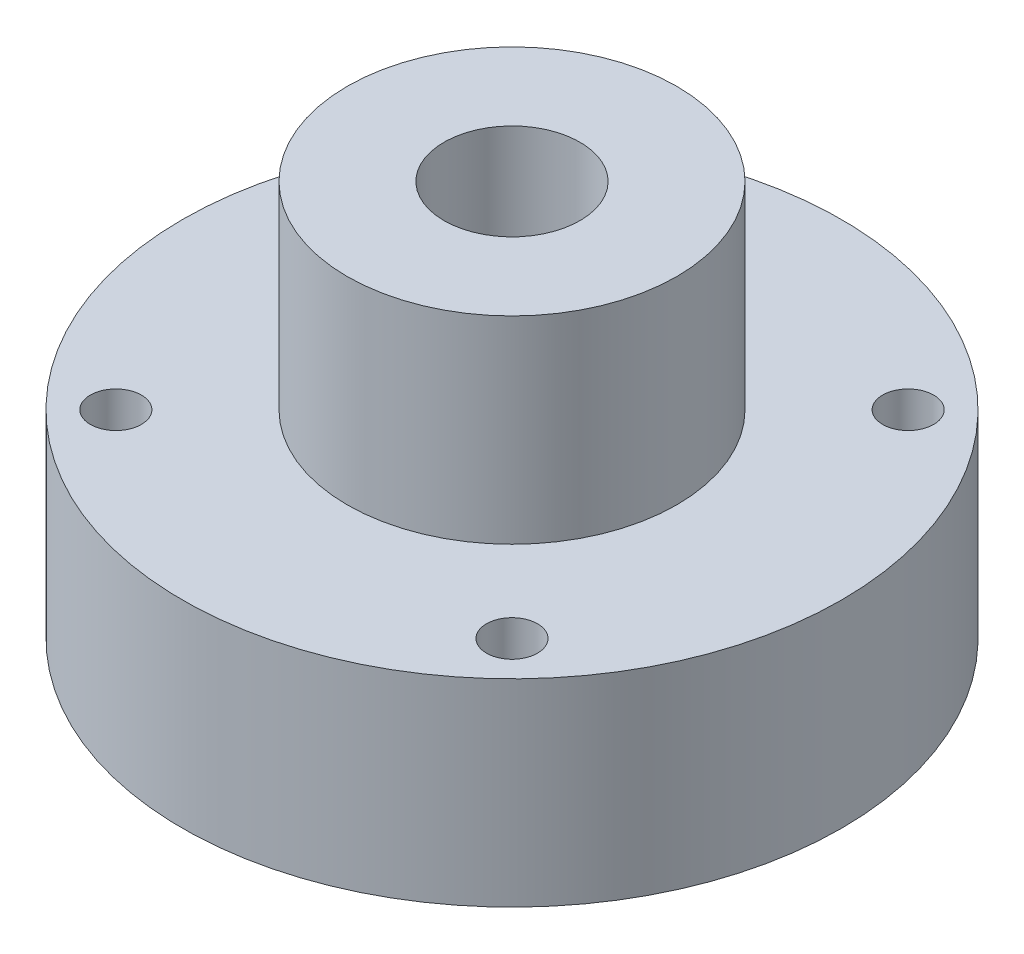
ISO-10303-21;
HEADER;
FILE_DESCRIPTION(('STEP AP214'),'2;1');
FILE_NAME('part.step','',(''),(''),'','','');
FILE_SCHEMA(('AUTOMOTIVE_DESIGN { 1 0 10303 214 1 1 1 1 }'));
ENDSEC;
DATA;
#1=APPLICATION_CONTEXT('core data for automotive mechanical design processes');
#2=APPLICATION_PROTOCOL_DEFINITION('international standard','automotive_design',2000,#1);
#3=PRODUCT_CONTEXT('',#1,'mechanical');
#4=PRODUCT('Part','Part','',(#3));
#5=PRODUCT_RELATED_PRODUCT_CATEGORY('part','',(#4));
#6=PRODUCT_DEFINITION_FORMATION('','',#4);
#7=PRODUCT_DEFINITION_CONTEXT('part definition',#1,'design');
#8=PRODUCT_DEFINITION('design','',#6,#7);
#9=PRODUCT_DEFINITION_SHAPE('','',#8);
#10=(LENGTH_UNIT() NAMED_UNIT(*) SI_UNIT(.MILLI.,.METRE.));
#11=(NAMED_UNIT(*) PLANE_ANGLE_UNIT() SI_UNIT($,.RADIAN.));
#12=(NAMED_UNIT(*) SI_UNIT($,.STERADIAN.) SOLID_ANGLE_UNIT());
#13=UNCERTAINTY_MEASURE_WITH_UNIT(LENGTH_MEASURE(1.E-05),#10,'distance_accuracy_value','');
#14=(GEOMETRIC_REPRESENTATION_CONTEXT(3) GLOBAL_UNCERTAINTY_ASSIGNED_CONTEXT((#13)) GLOBAL_UNIT_ASSIGNED_CONTEXT((#10,
#11,#12)) REPRESENTATION_CONTEXT('',''));
#15=CARTESIAN_POINT('',(0.,0.,0.));
#16=DIRECTION('',(0.,0.,1.));
#17=DIRECTION('',(1.,0.,0.));
#18=AXIS2_PLACEMENT_3D('',#15,#16,#17);
#19=CARTESIAN_POINT('',(0.,-38.1000000000001,0.));
#20=DIRECTION('',(0.,-1.,0.));
#21=DIRECTION('',(1.,0.,0.));
#22=AXIS2_PLACEMENT_3D('',#19,#20,#21);
#23=PLANE('',#22);
#24=CARTESIAN_POINT('',(-1.81426335150066E-13,-38.1000000000001,0.));
#25=DIRECTION('',(0.,1.,0.));
#26=DIRECTION('',(-1.,0.,0.));
#27=AXIS2_PLACEMENT_3D('',#24,#25,#26);
#28=CIRCLE('',#27,12.6999999999998);
#29=CARTESIAN_POINT('',(-12.7,-38.1,0.));
#30=VERTEX_POINT('',#29);
#31=EDGE_CURVE('E10',#30,#30,#28,.T.);
#32=ORIENTED_EDGE('',*,*,#31,.T.);
#33=EDGE_LOOP('',(#32));
#34=FACE_BOUND('',#33,.T.);
#35=CARTESIAN_POINT('',(-1.81426335150066E-13,-38.1000000000001,0.));
#36=DIRECTION('',(0.,1.,0.));
#37=DIRECTION('',(-1.,0.,0.));
#38=AXIS2_PLACEMENT_3D('',#35,#36,#37);
#39=CIRCLE('',#38,19.0372999999998);
#40=CARTESIAN_POINT('',(-19.0373,-38.1,0.));
#41=VERTEX_POINT('',#40);
#42=EDGE_CURVE('E67',#41,#41,#39,.T.);
#43=ORIENTED_EDGE('',*,*,#42,.F.);
#44=EDGE_LOOP('',(#43));
#45=FACE_BOUND('',#44,.T.);
#46=ADVANCED_FACE('F36',(#34,#45),#23,.T.);
#47=CARTESIAN_POINT('',(-1.81426335150066E-13,-38.1000000000001,0.));
#48=DIRECTION('',(0.,-1.,0.));
#49=DIRECTION('',(1.,0.,0.));
#50=AXIS2_PLACEMENT_3D('',#47,#48,#49);
#51=CONICAL_SURFACE('',#50,12.6999999999998,0.463647609000801);
#52=CARTESIAN_POINT('',(-1.22841352512309E-13,-25.7970020000003,0.));
#53=DIRECTION('',(0.,-1.,0.));
#54=DIRECTION('',(1.,0.,0.));
#55=AXIS2_PLACEMENT_3D('',#52,#53,#54);
#56=CIRCLE('',#55,6.54850099999999);
#57=CARTESIAN_POINT('',(6.54850099999987,-25.7970020000003,0.));
#58=VERTEX_POINT('',#57);
#59=EDGE_CURVE('E91',#58,#58,#56,.T.);
#60=ORIENTED_EDGE('',*,*,#59,.F.);
#61=EDGE_LOOP('',(#60));
#62=FACE_BOUND('',#61,.T.);
#63=ORIENTED_EDGE('',*,*,#31,.F.);
#64=EDGE_LOOP('',(#63));
#65=FACE_BOUND('',#64,.T.);
#66=ADVANCED_FACE('F104',(#62,#65),#51,.F.);
#67=CARTESIAN_POINT('',(0.,0.,0.));
#68=DIRECTION('',(0.,-1.,0.));
#69=DIRECTION('',(1.,0.,0.));
#70=AXIS2_PLACEMENT_3D('',#67,#68,#69);
#71=PLANE('',#70);
#72=CARTESIAN_POINT('',(0.,0.,0.));
#73=DIRECTION('',(0.,1.,0.));
#74=DIRECTION('',(0.,0.,1.));
#75=AXIS2_PLACEMENT_3D('',#72,#73,#74);
#76=CIRCLE('',#75,6.54850099999999);
#77=CARTESIAN_POINT('',(0.,0.,6.54850099999999));
#78=VERTEX_POINT('',#77);
#79=EDGE_CURVE('E94',#78,#78,#76,.T.);
#80=ORIENTED_EDGE('',*,*,#79,.F.);
#81=EDGE_LOOP('',(#80));
#82=FACE_BOUND('',#81,.T.);
#83=CARTESIAN_POINT('',(0.,0.,0.));
#84=DIRECTION('',(0.,1.,0.));
#85=DIRECTION('',(-1.,0.,0.));
#86=AXIS2_PLACEMENT_3D('',#83,#84,#85);
#87=CIRCLE('',#86,15.875);
#88=CARTESIAN_POINT('',(-15.875,0.,0.));
#89=VERTEX_POINT('',#88);
#90=EDGE_CURVE('E43',#89,#89,#87,.T.);
#91=ORIENTED_EDGE('',*,*,#90,.T.);
#92=EDGE_LOOP('',(#91));
#93=FACE_BOUND('',#92,.T.);
#94=ADVANCED_FACE('F100',(#82,#93),#71,.F.);
#95=CARTESIAN_POINT('',(0.,0.,0.));
#96=DIRECTION('',(0.,1.,0.));
#97=DIRECTION('',(-1.,0.,0.));
#98=AXIS2_PLACEMENT_3D('',#95,#96,#97);
#99=CYLINDRICAL_SURFACE('',#98,15.875);
#100=ORIENTED_EDGE('',*,*,#90,.F.);
#101=EDGE_LOOP('',(#100));
#102=FACE_BOUND('',#101,.T.);
#103=CARTESIAN_POINT('',(0.,-19.0500000000001,0.));
#104=DIRECTION('',(0.,1.,0.));
#105=DIRECTION('',(-1.,0.,0.));
#106=AXIS2_PLACEMENT_3D('',#103,#104,#105);
#107=CIRCLE('',#106,15.8749999999999);
#108=CARTESIAN_POINT('',(-15.875,-19.05,0.));
#109=VERTEX_POINT('',#108);
#110=EDGE_CURVE('E47',#109,#109,#107,.T.);
#111=ORIENTED_EDGE('',*,*,#110,.T.);
#112=EDGE_LOOP('',(#111));
#113=FACE_BOUND('',#112,.T.);
#114=ADVANCED_FACE('F103',(#102,#113),#99,.T.);
#115=CARTESIAN_POINT('',(0.,-19.0500000000001,0.));
#116=DIRECTION('',(0.,-1.,0.));
#117=DIRECTION('',(1.,0.,0.));
#118=AXIS2_PLACEMENT_3D('',#115,#116,#117);
#119=PLANE('',#118);
#120=CARTESIAN_POINT('',(19.0830442572718,-19.0500000000002,-19.083044257272));
#121=DIRECTION('',(0.,-1.,0.));
#122=DIRECTION('',(1.,0.,0.));
#123=AXIS2_PLACEMENT_3D('',#120,#121,#122);
#124=CIRCLE('',#123,2.45744999999999);
#125=CARTESIAN_POINT('',(21.5404942572718,-19.0500000000002,-19.083044257272));
#126=VERTEX_POINT('',#125);
#127=EDGE_CURVE('E85',#126,#126,#124,.T.);
#128=ORIENTED_EDGE('',*,*,#127,.T.);
#129=EDGE_LOOP('',(#128));
#130=FACE_BOUND('',#129,.T.);
#131=CARTESIAN_POINT('',(-19.0830442572721,-19.05,-19.0830442572718));
#132=DIRECTION('',(0.,-1.,0.));
#133=DIRECTION('',(1.,0.,0.));
#134=AXIS2_PLACEMENT_3D('',#131,#132,#133);
#135=CIRCLE('',#134,2.45744999999999);
#136=CARTESIAN_POINT('',(-16.6255942572721,-19.05,-19.0830442572718));
#137=VERTEX_POINT('',#136);
#138=EDGE_CURVE('E79',#137,#137,#135,.T.);
#139=ORIENTED_EDGE('',*,*,#138,.T.);
#140=EDGE_LOOP('',(#139));
#141=FACE_BOUND('',#140,.T.);
#142=CARTESIAN_POINT('',(-19.0830442572718,-19.05,19.083044257272));
#143=DIRECTION('',(0.,-1.,0.));
#144=DIRECTION('',(1.,0.,0.));
#145=AXIS2_PLACEMENT_3D('',#142,#143,#144);
#146=CIRCLE('',#145,2.45744999999999);
#147=CARTESIAN_POINT('',(-16.6255942572718,-19.05,19.083044257272));
#148=VERTEX_POINT('',#147);
#149=EDGE_CURVE('E39',#148,#148,#146,.T.);
#150=ORIENTED_EDGE('',*,*,#149,.T.);
#151=EDGE_LOOP('',(#150));
#152=FACE_BOUND('',#151,.T.);
#153=CARTESIAN_POINT('',(19.0830442572721,-19.0500000000002,19.0830442572718));
#154=DIRECTION('',(0.,-1.,0.));
#155=DIRECTION('',(1.,0.,0.));
#156=AXIS2_PLACEMENT_3D('',#153,#154,#155);
#157=CIRCLE('',#156,2.45744999999999);
#158=CARTESIAN_POINT('',(21.540494257272,-19.0500000000002,19.0830442572718));
#159=VERTEX_POINT('',#158);
#160=EDGE_CURVE('E70',#159,#159,#157,.T.);
#161=ORIENTED_EDGE('',*,*,#160,.T.);
#162=EDGE_LOOP('',(#161));
#163=FACE_BOUND('',#162,.T.);
#164=ORIENTED_EDGE('',*,*,#110,.F.);
#165=EDGE_LOOP('',(#164));
#166=FACE_BOUND('',#165,.T.);
#167=CARTESIAN_POINT('',(0.,-19.0500000000002,0.));
#168=DIRECTION('',(0.,1.,0.));
#169=DIRECTION('',(-1.,0.,0.));
#170=AXIS2_PLACEMENT_3D('',#167,#168,#169);
#171=CIRCLE('',#170,31.7499999999999);
#172=CARTESIAN_POINT('',(-31.75,-19.05,0.));
#173=VERTEX_POINT('',#172);
#174=EDGE_CURVE('E52',#173,#173,#171,.T.);
#175=ORIENTED_EDGE('',*,*,#174,.T.);
#176=EDGE_LOOP('',(#175));
#177=FACE_BOUND('',#176,.T.);
#178=ADVANCED_FACE('F110',(#130,#141,#152,#163,#166,#177),#119,.F.);
#179=CARTESIAN_POINT('',(0.,0.,0.));
#180=DIRECTION('',(0.,1.,0.));
#181=DIRECTION('',(-1.,0.,0.));
#182=AXIS2_PLACEMENT_3D('',#179,#180,#181);
#183=CYLINDRICAL_SURFACE('',#182,31.7499999999999);
#184=CARTESIAN_POINT('',(-1.81426335150067E-13,-38.1000000000002,0.));
#185=DIRECTION('',(0.,1.,0.));
#186=DIRECTION('',(-1.,0.,0.));
#187=AXIS2_PLACEMENT_3D('',#184,#185,#186);
#188=CIRCLE('',#187,31.7499999999998);
#189=CARTESIAN_POINT('',(-31.75,-38.1,0.));
#190=VERTEX_POINT('',#189);
#191=EDGE_CURVE('E55',#190,#190,#188,.T.);
#192=ORIENTED_EDGE('',*,*,#191,.T.);
#193=EDGE_LOOP('',(#192));
#194=FACE_BOUND('',#193,.T.);
#195=ORIENTED_EDGE('',*,*,#174,.F.);
#196=EDGE_LOOP('',(#195));
#197=FACE_BOUND('',#196,.T.);
#198=ADVANCED_FACE('F116',(#194,#197),#183,.T.);
#199=CARTESIAN_POINT('',(0.,-38.1000000000001,0.));
#200=DIRECTION('',(0.,-1.,0.));
#201=DIRECTION('',(1.,0.,0.));
#202=AXIS2_PLACEMENT_3D('',#199,#200,#201);
#203=PLANE('',#202);
#204=CARTESIAN_POINT('',(19.0830442572718,-38.1000000000002,-19.083044257272));
#205=DIRECTION('',(0.,1.,0.));
#206=DIRECTION('',(0.,0.,1.));
#207=AXIS2_PLACEMENT_3D('',#204,#205,#206);
#208=CIRCLE('',#207,2.45744999999999);
#209=CARTESIAN_POINT('',(19.0830442572718,-38.1000000000002,-16.625594257272));
#210=VERTEX_POINT('',#209);
#211=EDGE_CURVE('E88',#210,#210,#208,.T.);
#212=ORIENTED_EDGE('',*,*,#211,.T.);
#213=EDGE_LOOP('',(#212));
#214=FACE_BOUND('',#213,.T.);
#215=CARTESIAN_POINT('',(-19.0830442572721,-38.1000000000002,-19.0830442572718));
#216=DIRECTION('',(0.,1.,0.));
#217=DIRECTION('',(0.,0.,1.));
#218=AXIS2_PLACEMENT_3D('',#215,#216,#217);
#219=CIRCLE('',#218,2.45744999999999);
#220=CARTESIAN_POINT('',(-19.0830442572721,-38.1000000000002,-16.6255942572719));
#221=VERTEX_POINT('',#220);
#222=EDGE_CURVE('E82',#221,#221,#219,.T.);
#223=ORIENTED_EDGE('',*,*,#222,.T.);
#224=EDGE_LOOP('',(#223));
#225=FACE_BOUND('',#224,.T.);
#226=CARTESIAN_POINT('',(-19.0830442572718,-38.1000000000002,19.083044257272));
#227=DIRECTION('',(0.,1.,0.));
#228=DIRECTION('',(0.,0.,1.));
#229=AXIS2_PLACEMENT_3D('',#226,#227,#228);
#230=CIRCLE('',#229,2.45744999999999);
#231=CARTESIAN_POINT('',(-19.0830442572718,-38.1000000000002,21.540494257272));
#232=VERTEX_POINT('',#231);
#233=EDGE_CURVE('E76',#232,#232,#230,.T.);
#234=ORIENTED_EDGE('',*,*,#233,.T.);
#235=EDGE_LOOP('',(#234));
#236=FACE_BOUND('',#235,.T.);
#237=CARTESIAN_POINT('',(19.0830442572721,-38.1000000000002,19.0830442572718));
#238=DIRECTION('',(0.,1.,0.));
#239=DIRECTION('',(0.,0.,1.));
#240=AXIS2_PLACEMENT_3D('',#237,#238,#239);
#241=CIRCLE('',#240,2.45744999999999);
#242=CARTESIAN_POINT('',(19.0830442572721,-38.1000000000002,21.5404942572718));
#243=VERTEX_POINT('',#242);
#244=EDGE_CURVE('E73',#243,#243,#241,.T.);
#245=ORIENTED_EDGE('',*,*,#244,.T.);
#246=EDGE_LOOP('',(#245));
#247=FACE_BOUND('',#246,.T.);
#248=CARTESIAN_POINT('',(-1.81426335150066E-13,-38.1000000000001,0.));
#249=DIRECTION('',(0.,1.,0.));
#250=DIRECTION('',(-1.,0.,0.));
#251=AXIS2_PLACEMENT_3D('',#248,#249,#250);
#252=CIRCLE('',#251,23.8124999999998);
#253=CARTESIAN_POINT('',(-23.8125,-38.1,0.));
#254=VERTEX_POINT('',#253);
#255=EDGE_CURVE('E58',#254,#254,#252,.T.);
#256=ORIENTED_EDGE('',*,*,#255,.T.);
#257=EDGE_LOOP('',(#256));
#258=FACE_BOUND('',#257,.T.);
#259=ORIENTED_EDGE('',*,*,#191,.F.);
#260=EDGE_LOOP('',(#259));
#261=FACE_BOUND('',#260,.T.);
#262=ADVANCED_FACE('F122',(#214,#225,#236,#247,#258,#261),#203,.T.);
#263=CARTESIAN_POINT('',(0.,0.,0.));
#264=DIRECTION('',(0.,1.,0.));
#265=DIRECTION('',(-1.,0.,0.));
#266=AXIS2_PLACEMENT_3D('',#263,#264,#265);
#267=CYLINDRICAL_SURFACE('',#266,23.8124999999998);
#268=CARTESIAN_POINT('',(-1.66488900222711E-13,-34.9631000000001,0.));
#269=DIRECTION('',(0.,1.,0.));
#270=DIRECTION('',(-1.,0.,0.));
#271=AXIS2_PLACEMENT_3D('',#268,#269,#270);
#272=CIRCLE('',#271,23.8124999999998);
#273=CARTESIAN_POINT('',(-23.8125,-34.9631,0.));
#274=VERTEX_POINT('',#273);
#275=EDGE_CURVE('E61',#274,#274,#272,.T.);
#276=ORIENTED_EDGE('',*,*,#275,.T.);
#277=EDGE_LOOP('',(#276));
#278=FACE_BOUND('',#277,.T.);
#279=ORIENTED_EDGE('',*,*,#255,.F.);
#280=EDGE_LOOP('',(#279));
#281=FACE_BOUND('',#280,.T.);
#282=ADVANCED_FACE('F128',(#278,#281),#267,.F.);
#283=CARTESIAN_POINT('',(0.,-34.9631000000001,0.));
#284=DIRECTION('',(0.,-1.,0.));
#285=DIRECTION('',(1.,0.,0.));
#286=AXIS2_PLACEMENT_3D('',#283,#284,#285);
#287=PLANE('',#286);
#288=CARTESIAN_POINT('',(-1.66488900222711E-13,-34.9631000000001,0.));
#289=DIRECTION('',(0.,1.,0.));
#290=DIRECTION('',(-1.,0.,0.));
#291=AXIS2_PLACEMENT_3D('',#288,#289,#290);
#292=CIRCLE('',#291,19.0372999999998);
#293=CARTESIAN_POINT('',(-19.0373,-34.9631,0.));
#294=VERTEX_POINT('',#293);
#295=EDGE_CURVE('E64',#294,#294,#292,.T.);
#296=ORIENTED_EDGE('',*,*,#295,.T.);
#297=EDGE_LOOP('',(#296));
#298=FACE_BOUND('',#297,.T.);
#299=ORIENTED_EDGE('',*,*,#275,.F.);
#300=EDGE_LOOP('',(#299));
#301=FACE_BOUND('',#300,.T.);
#302=ADVANCED_FACE('F143',(#298,#301),#287,.T.);
#303=CARTESIAN_POINT('',(0.,0.,0.));
#304=DIRECTION('',(0.,1.,0.));
#305=DIRECTION('',(-1.,0.,0.));
#306=AXIS2_PLACEMENT_3D('',#303,#304,#305);
#307=CYLINDRICAL_SURFACE('',#306,19.0372999999998);
#308=ORIENTED_EDGE('',*,*,#42,.T.);
#309=EDGE_LOOP('',(#308));
#310=FACE_BOUND('',#309,.T.);
#311=ORIENTED_EDGE('',*,*,#295,.F.);
#312=EDGE_LOOP('',(#311));
#313=FACE_BOUND('',#312,.T.);
#314=ADVANCED_FACE('F139',(#310,#313),#307,.T.);
#315=CARTESIAN_POINT('',(19.0830442572721,0.,19.0830442572718));
#316=DIRECTION('',(0.,1.,0.));
#317=DIRECTION('',(0.,0.,1.));
#318=AXIS2_PLACEMENT_3D('',#315,#316,#317);
#319=CYLINDRICAL_SURFACE('',#318,2.45744999999999);
#320=ORIENTED_EDGE('',*,*,#244,.F.);
#321=EDGE_LOOP('',(#320));
#322=FACE_BOUND('',#321,.T.);
#323=ORIENTED_EDGE('',*,*,#160,.F.);
#324=EDGE_LOOP('',(#323));
#325=FACE_BOUND('',#324,.T.);
#326=ADVANCED_FACE('F142',(#322,#325),#319,.F.);
#327=CARTESIAN_POINT('',(-19.0830442572718,0.,19.083044257272));
#328=DIRECTION('',(0.,1.,0.));
#329=DIRECTION('',(0.,0.,1.));
#330=AXIS2_PLACEMENT_3D('',#327,#328,#329);
#331=CYLINDRICAL_SURFACE('',#330,2.45744999999999);
#332=ORIENTED_EDGE('',*,*,#233,.F.);
#333=EDGE_LOOP('',(#332));
#334=FACE_BOUND('',#333,.T.);
#335=ORIENTED_EDGE('',*,*,#149,.F.);
#336=EDGE_LOOP('',(#335));
#337=FACE_BOUND('',#336,.T.);
#338=ADVANCED_FACE('F164',(#334,#337),#331,.F.);
#339=CARTESIAN_POINT('',(-19.0830442572721,0.,-19.0830442572718));
#340=DIRECTION('',(0.,1.,0.));
#341=DIRECTION('',(0.,0.,1.));
#342=AXIS2_PLACEMENT_3D('',#339,#340,#341);
#343=CYLINDRICAL_SURFACE('',#342,2.45744999999999);
#344=ORIENTED_EDGE('',*,*,#222,.F.);
#345=EDGE_LOOP('',(#344));
#346=FACE_BOUND('',#345,.T.);
#347=ORIENTED_EDGE('',*,*,#138,.F.);
#348=EDGE_LOOP('',(#347));
#349=FACE_BOUND('',#348,.T.);
#350=ADVANCED_FACE('F168',(#346,#349),#343,.F.);
#351=CARTESIAN_POINT('',(19.0830442572718,0.,-19.083044257272));
#352=DIRECTION('',(0.,1.,0.));
#353=DIRECTION('',(0.,0.,1.));
#354=AXIS2_PLACEMENT_3D('',#351,#352,#353);
#355=CYLINDRICAL_SURFACE('',#354,2.45744999999999);
#356=ORIENTED_EDGE('',*,*,#211,.F.);
#357=EDGE_LOOP('',(#356));
#358=FACE_BOUND('',#357,.T.);
#359=ORIENTED_EDGE('',*,*,#127,.F.);
#360=EDGE_LOOP('',(#359));
#361=FACE_BOUND('',#360,.T.);
#362=ADVANCED_FACE('F172',(#358,#361),#355,.F.);
#363=CARTESIAN_POINT('',(0.,0.,0.));
#364=DIRECTION('',(0.,1.,0.));
#365=DIRECTION('',(0.,0.,1.));
#366=AXIS2_PLACEMENT_3D('',#363,#364,#365);
#367=CYLINDRICAL_SURFACE('',#366,6.54850099999999);
#368=ORIENTED_EDGE('',*,*,#59,.T.);
#369=EDGE_LOOP('',(#368));
#370=FACE_BOUND('',#369,.T.);
#371=ORIENTED_EDGE('',*,*,#79,.T.);
#372=EDGE_LOOP('',(#371));
#373=FACE_BOUND('',#372,.T.);
#374=ADVANCED_FACE('F98',(#370,#373),#367,.F.);
#375=CLOSED_SHELL('',(#46,#66,#94,#114,#178,#198,#262,#282,#302,#314,#326,#338,#350,#362,#374));
#376=MANIFOLD_SOLID_BREP('B2',#375);
#377=ADVANCED_BREP_SHAPE_REPRESENTATION('',(#18,#376),#14);
#378=SHAPE_DEFINITION_REPRESENTATION(#9,#377);
ENDSEC;
END-ISO-10303-21;
